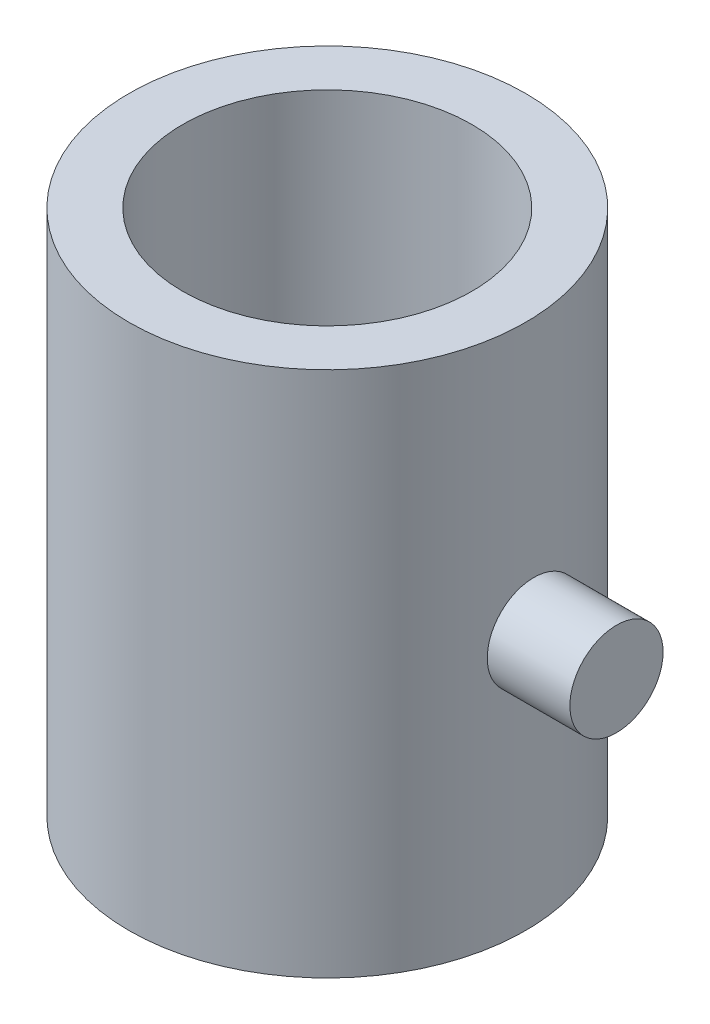
ISO-10303-21;
HEADER;
FILE_DESCRIPTION(('STEP AP214'),'2;1');
FILE_NAME('part.step','',(''),(''),'','','');
FILE_SCHEMA(('AUTOMOTIVE_DESIGN { 1 0 10303 214 1 1 1 1 }'));
ENDSEC;
DATA;
#1=APPLICATION_CONTEXT('core data for automotive mechanical design processes');
#2=APPLICATION_PROTOCOL_DEFINITION('international standard','automotive_design',2000,#1);
#3=PRODUCT_CONTEXT('',#1,'mechanical');
#4=PRODUCT('Part','Part','',(#3));
#5=PRODUCT_RELATED_PRODUCT_CATEGORY('part','',(#4));
#6=PRODUCT_DEFINITION_FORMATION('','',#4);
#7=PRODUCT_DEFINITION_CONTEXT('part definition',#1,'design');
#8=PRODUCT_DEFINITION('design','',#6,#7);
#9=PRODUCT_DEFINITION_SHAPE('','',#8);
#10=(LENGTH_UNIT() NAMED_UNIT(*) SI_UNIT(.MILLI.,.METRE.));
#11=(NAMED_UNIT(*) PLANE_ANGLE_UNIT() SI_UNIT($,.RADIAN.));
#12=(NAMED_UNIT(*) SI_UNIT($,.STERADIAN.) SOLID_ANGLE_UNIT());
#13=UNCERTAINTY_MEASURE_WITH_UNIT(LENGTH_MEASURE(1.E-05),#10,'distance_accuracy_value','');
#14=(GEOMETRIC_REPRESENTATION_CONTEXT(3) GLOBAL_UNCERTAINTY_ASSIGNED_CONTEXT((#13)) GLOBAL_UNIT_ASSIGNED_CONTEXT((#10,
#11,#12)) REPRESENTATION_CONTEXT('',''));
#15=CARTESIAN_POINT('',(0.,0.,0.));
#16=DIRECTION('',(0.,0.,1.));
#17=DIRECTION('',(1.,0.,0.));
#18=AXIS2_PLACEMENT_3D('',#15,#16,#17);
#19=CARTESIAN_POINT('',(7.,0.,0.));
#20=DIRECTION('',(-1.,0.,0.));
#21=DIRECTION('',(0.,0.,1.));
#22=AXIS2_PLACEMENT_3D('',#19,#20,#21);
#23=CYLINDRICAL_SURFACE('',#22,1.12812329127767);
#24=CARTESIAN_POINT('',(7.,0.,0.));
#25=DIRECTION('',(1.,0.,0.));
#26=DIRECTION('',(0.,0.,-1.));
#27=AXIS2_PLACEMENT_3D('',#24,#25,#26);
#28=CIRCLE('',#27,1.12812329127767);
#29=CARTESIAN_POINT('',(7.,0.,-1.12812329127767));
#30=VERTEX_POINT('',#29);
#31=EDGE_CURVE('E11',#30,#30,#28,.T.);
#32=ORIENTED_EDGE('',*,*,#31,.F.);
#33=EDGE_LOOP('',(#32));
#34=FACE_BOUND('',#33,.T.);
#35=CARTESIAN_POINT('',(5.,0.,0.));
#36=DIRECTION('',(1.,0.,0.));
#37=DIRECTION('',(0.,0.,-1.));
#38=AXIS2_PLACEMENT_3D('',#35,#36,#37);
#39=CIRCLE('',#38,1.12812329127767);
#40=CARTESIAN_POINT('',(5.,0.,-1.12812329127767));
#41=VERTEX_POINT('',#40);
#42=EDGE_CURVE('E50',#41,#41,#39,.T.);
#43=ORIENTED_EDGE('',*,*,#42,.T.);
#44=EDGE_LOOP('',(#43));
#45=FACE_BOUND('',#44,.T.);
#46=ADVANCED_FACE('F47',(#34,#45),#23,.T.);
#47=CARTESIAN_POINT('',(7.,0.,0.));
#48=DIRECTION('',(1.,0.,0.));
#49=DIRECTION('',(0.,0.,-1.));
#50=AXIS2_PLACEMENT_3D('',#47,#48,#49);
#51=PLANE('',#50);
#52=ORIENTED_EDGE('',*,*,#31,.T.);
#53=EDGE_LOOP('',(#52));
#54=FACE_BOUND('',#53,.T.);
#55=ADVANCED_FACE('F67',(#54),#51,.T.);
#56=CARTESIAN_POINT('',(5.,0.,0.));
#57=DIRECTION('',(1.,0.,0.));
#58=DIRECTION('',(0.,0.,-1.));
#59=AXIS2_PLACEMENT_3D('',#56,#57,#58);
#60=PLANE('',#59);
#61=ORIENTED_EDGE('',*,*,#42,.F.);
#62=EDGE_LOOP('',(#61));
#63=FACE_BOUND('',#62,.T.);
#64=ADVANCED_FACE('F65',(#63),#60,.F.);
#65=CLOSED_SHELL('',(#46,#55,#64));
#66=MANIFOLD_SOLID_BREP('B2',#65);
#67=CARTESIAN_POINT('',(0.,6.375,0.));
#68=DIRECTION('',(0.,1.,0.));
#69=DIRECTION('',(0.,0.,1.));
#70=AXIS2_PLACEMENT_3D('',#67,#68,#69);
#71=PLANE('',#70);
#72=CARTESIAN_POINT('',(0.,6.375,0.));
#73=DIRECTION('',(0.,1.,0.));
#74=DIRECTION('',(0.,0.,1.));
#75=AXIS2_PLACEMENT_3D('',#72,#73,#74);
#76=CIRCLE('',#75,4.8);
#77=CARTESIAN_POINT('',(0.,6.375,4.8));
#78=VERTEX_POINT('',#77);
#79=EDGE_CURVE('E46',#78,#78,#76,.T.);
#80=ORIENTED_EDGE('',*,*,#79,.T.);
#81=EDGE_LOOP('',(#80));
#82=FACE_BOUND('',#81,.T.);
#83=CARTESIAN_POINT('',(0.,6.375,0.));
#84=DIRECTION('',(0.,1.,0.));
#85=DIRECTION('',(0.,0.,1.));
#86=AXIS2_PLACEMENT_3D('',#83,#84,#85);
#87=CIRCLE('',#86,3.5);
#88=CARTESIAN_POINT('',(0.,6.375,3.5));
#89=VERTEX_POINT('',#88);
#90=EDGE_CURVE('E111',#89,#89,#87,.T.);
#91=ORIENTED_EDGE('',*,*,#90,.F.);
#92=EDGE_LOOP('',(#91));
#93=FACE_BOUND('',#92,.T.);
#94=ADVANCED_FACE('F96',(#82,#93),#71,.T.);
#95=CARTESIAN_POINT('',(0.,-6.375,0.));
#96=DIRECTION('',(0.,1.,0.));
#97=DIRECTION('',(0.,0.,1.));
#98=AXIS2_PLACEMENT_3D('',#95,#96,#97);
#99=PLANE('',#98);
#100=CARTESIAN_POINT('',(0.,-6.375,0.));
#101=DIRECTION('',(0.,1.,0.));
#102=DIRECTION('',(0.,0.,1.));
#103=AXIS2_PLACEMENT_3D('',#100,#101,#102);
#104=CIRCLE('',#103,4.8);
#105=CARTESIAN_POINT('',(0.,-6.375,4.8));
#106=VERTEX_POINT('',#105);
#107=EDGE_CURVE('E100',#106,#106,#104,.T.);
#108=ORIENTED_EDGE('',*,*,#107,.F.);
#109=EDGE_LOOP('',(#108));
#110=FACE_BOUND('',#109,.T.);
#111=CARTESIAN_POINT('',(0.,-6.375,0.));
#112=DIRECTION('',(0.,1.,0.));
#113=DIRECTION('',(0.,0.,1.));
#114=AXIS2_PLACEMENT_3D('',#111,#112,#113);
#115=CIRCLE('',#114,3.5);
#116=CARTESIAN_POINT('',(0.,-6.375,3.5));
#117=VERTEX_POINT('',#116);
#118=EDGE_CURVE('E113',#117,#117,#115,.T.);
#119=ORIENTED_EDGE('',*,*,#118,.T.);
#120=EDGE_LOOP('',(#119));
#121=FACE_BOUND('',#120,.T.);
#122=ADVANCED_FACE('F127',(#110,#121),#99,.F.);
#123=CARTESIAN_POINT('',(0.,6.375,0.));
#124=DIRECTION('',(0.,-1.,0.));
#125=DIRECTION('',(0.,0.,-1.));
#126=AXIS2_PLACEMENT_3D('',#123,#124,#125);
#127=CYLINDRICAL_SURFACE('',#126,4.8);
#128=ORIENTED_EDGE('',*,*,#79,.F.);
#129=EDGE_LOOP('',(#128));
#130=FACE_BOUND('',#129,.T.);
#131=ORIENTED_EDGE('',*,*,#107,.T.);
#132=EDGE_LOOP('',(#131));
#133=FACE_BOUND('',#132,.T.);
#134=ADVANCED_FACE('F98',(#130,#133),#127,.T.);
#135=CARTESIAN_POINT('',(0.,6.375,0.));
#136=DIRECTION('',(0.,-1.,0.));
#137=DIRECTION('',(0.,0.,-1.));
#138=AXIS2_PLACEMENT_3D('',#135,#136,#137);
#139=CYLINDRICAL_SURFACE('',#138,3.5);
#140=ORIENTED_EDGE('',*,*,#90,.T.);
#141=EDGE_LOOP('',(#140));
#142=FACE_BOUND('',#141,.T.);
#143=ORIENTED_EDGE('',*,*,#118,.F.);
#144=EDGE_LOOP('',(#143));
#145=FACE_BOUND('',#144,.T.);
#146=ADVANCED_FACE('F123',(#142,#145),#139,.F.);
#147=CLOSED_SHELL('',(#94,#122,#134,#146));
#148=MANIFOLD_SOLID_BREP('B6',#147);
#149=ADVANCED_BREP_SHAPE_REPRESENTATION('',(#18,#66,#148),#14);
#150=SHAPE_DEFINITION_REPRESENTATION(#9,#149);
ENDSEC;
END-ISO-10303-21;
